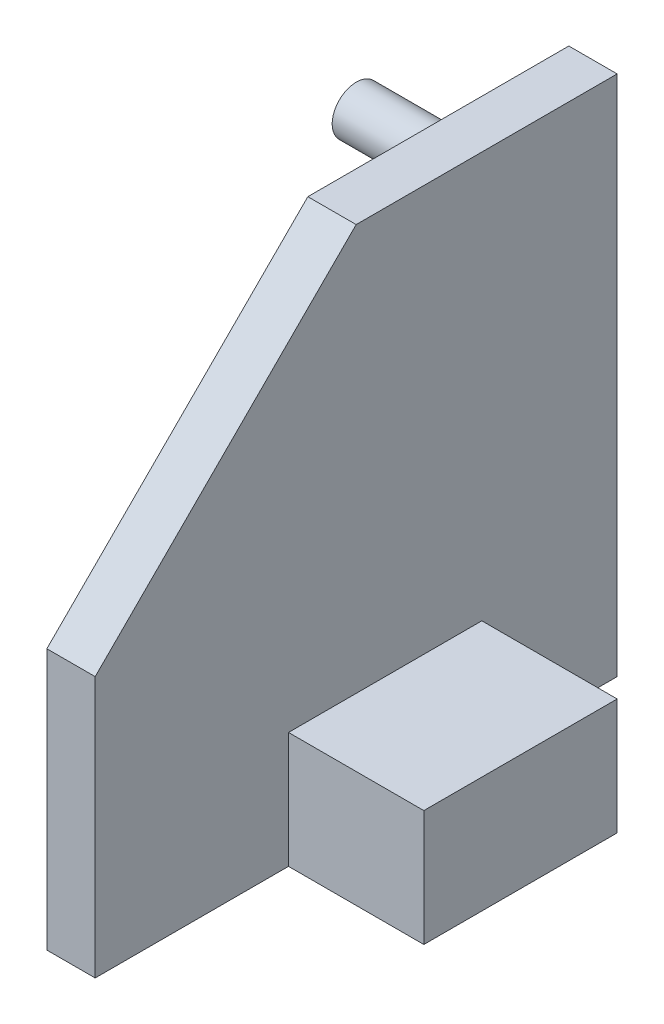
ISO-10303-21;
HEADER;
FILE_DESCRIPTION(('STEP AP214'),'2;1');
FILE_NAME('part.step','',(''),(''),'','','');
FILE_SCHEMA(('AUTOMOTIVE_DESIGN { 1 0 10303 214 1 1 1 1 }'));
ENDSEC;
DATA;
#1=APPLICATION_CONTEXT('core data for automotive mechanical design processes');
#2=APPLICATION_PROTOCOL_DEFINITION('international standard','automotive_design',2000,#1);
#3=PRODUCT_CONTEXT('',#1,'mechanical');
#4=PRODUCT('Part','Part','',(#3));
#5=PRODUCT_RELATED_PRODUCT_CATEGORY('part','',(#4));
#6=PRODUCT_DEFINITION_FORMATION('','',#4);
#7=PRODUCT_DEFINITION_CONTEXT('part definition',#1,'design');
#8=PRODUCT_DEFINITION('design','',#6,#7);
#9=PRODUCT_DEFINITION_SHAPE('','',#8);
#10=(LENGTH_UNIT() NAMED_UNIT(*) SI_UNIT(.MILLI.,.METRE.));
#11=(NAMED_UNIT(*) PLANE_ANGLE_UNIT() SI_UNIT($,.RADIAN.));
#12=(NAMED_UNIT(*) SI_UNIT($,.STERADIAN.) SOLID_ANGLE_UNIT());
#13=UNCERTAINTY_MEASURE_WITH_UNIT(LENGTH_MEASURE(1.E-05),#10,'distance_accuracy_value','');
#14=(GEOMETRIC_REPRESENTATION_CONTEXT(3) GLOBAL_UNCERTAINTY_ASSIGNED_CONTEXT((#13)) GLOBAL_UNIT_ASSIGNED_CONTEXT((#10,
#11,#12)) REPRESENTATION_CONTEXT('',''));
#15=CARTESIAN_POINT('',(0.,0.,0.));
#16=DIRECTION('',(0.,0.,1.));
#17=DIRECTION('',(1.,0.,0.));
#18=AXIS2_PLACEMENT_3D('',#15,#16,#17);
#19=CARTESIAN_POINT('',(2.5,0.,0.));
#20=DIRECTION('',(-1.,0.,0.));
#21=DIRECTION('',(0.,0.,1.));
#22=AXIS2_PLACEMENT_3D('',#19,#20,#21);
#23=PLANE('',#22);
#24=DIRECTION('',(0.,0.,1.));
#25=VECTOR('',#24,1.);
#26=CARTESIAN_POINT('',(2.5,27.,42.2709604363099));
#27=LINE('',#26,#25);
#28=CARTESIAN_POINT('',(2.5,27.,15.2709604363099));
#29=VERTEX_POINT('',#28);
#30=CARTESIAN_POINT('',(2.5,27.,28.7709604363099));
#31=VERTEX_POINT('',#30);
#32=EDGE_CURVE('E113',#29,#31,#27,.T.);
#33=ORIENTED_EDGE('',*,*,#32,.T.);
#34=DIRECTION('',(0.,0.707106781186548,-0.707106781186547));
#35=VECTOR('',#34,1.);
#36=CARTESIAN_POINT('',(2.5,13.5,42.2709604363099));
#37=LINE('',#36,#35);
#38=CARTESIAN_POINT('',(2.5,13.5,42.2709604363099));
#39=VERTEX_POINT('',#38);
#40=EDGE_CURVE('E104',#39,#31,#37,.T.);
#41=ORIENTED_EDGE('',*,*,#40,.F.);
#42=DIRECTION('',(0.,-1.,0.));
#43=VECTOR('',#42,1.);
#44=CARTESIAN_POINT('',(2.5,0.,42.2709604363099));
#45=LINE('',#44,#43);
#46=CARTESIAN_POINT('',(2.5,0.,42.2709604363099));
#47=VERTEX_POINT('',#46);
#48=EDGE_CURVE('E110',#39,#47,#45,.T.);
#49=ORIENTED_EDGE('',*,*,#48,.T.);
#50=DIRECTION('',(0.,0.,-1.));
#51=VECTOR('',#50,1.);
#52=CARTESIAN_POINT('',(2.5,0.,42.2709604363099));
#53=LINE('',#52,#51);
#54=CARTESIAN_POINT('',(2.5,0.,32.2709604363099));
#55=VERTEX_POINT('',#54);
#56=EDGE_CURVE('E121',#47,#55,#53,.T.);
#57=ORIENTED_EDGE('',*,*,#56,.T.);
#58=DIRECTION('',(0.,-1.,0.));
#59=VECTOR('',#58,1.);
#60=CARTESIAN_POINT('',(2.5,0.,32.2709604363099));
#61=LINE('',#60,#59);
#62=CARTESIAN_POINT('',(2.5,6.,32.2709604363099));
#63=VERTEX_POINT('',#62);
#64=EDGE_CURVE('E55',#63,#55,#61,.T.);
#65=ORIENTED_EDGE('',*,*,#64,.F.);
#66=DIRECTION('',(0.,0.,1.));
#67=VECTOR('',#66,1.);
#68=CARTESIAN_POINT('',(2.5,6.,32.2709604363099));
#69=LINE('',#68,#67);
#70=CARTESIAN_POINT('',(2.5,6.,22.2709604363099));
#71=VERTEX_POINT('',#70);
#72=EDGE_CURVE('E169',#71,#63,#69,.T.);
#73=ORIENTED_EDGE('',*,*,#72,.F.);
#74=DIRECTION('',(0.,1.,0.));
#75=VECTOR('',#74,1.);
#76=CARTESIAN_POINT('',(2.5,0.,22.2709604363099));
#77=LINE('',#76,#75);
#78=CARTESIAN_POINT('',(2.5,0.,22.2709604363099));
#79=VERTEX_POINT('',#78);
#80=EDGE_CURVE('E180',#79,#71,#77,.T.);
#81=ORIENTED_EDGE('',*,*,#80,.F.);
#82=CARTESIAN_POINT('',(2.5,0.,15.2709604363099));
#83=VERTEX_POINT('',#82);
#84=EDGE_CURVE('E118',#79,#83,#53,.T.);
#85=ORIENTED_EDGE('',*,*,#84,.T.);
#86=DIRECTION('',(0.,1.,0.));
#87=VECTOR('',#86,1.);
#88=CARTESIAN_POINT('',(2.5,0.,15.2709604363099));
#89=LINE('',#88,#87);
#90=EDGE_CURVE('E132',#83,#29,#89,.T.);
#91=ORIENTED_EDGE('',*,*,#90,.T.);
#92=EDGE_LOOP('',(#33,#41,#49,#57,#65,#73,#81,#85,#91));
#93=FACE_BOUND('',#92,.T.);
#94=ADVANCED_FACE('F33',(#93),#23,.F.);
#95=CARTESIAN_POINT('',(2.5,0.,42.2709604363099));
#96=DIRECTION('',(0.,0.,-1.));
#97=DIRECTION('',(-1.,0.,0.));
#98=AXIS2_PLACEMENT_3D('',#95,#96,#97);
#99=PLANE('',#98);
#100=ORIENTED_EDGE('',*,*,#48,.F.);
#101=DIRECTION('',(1.,0.,0.));
#102=VECTOR('',#101,1.);
#103=CARTESIAN_POINT('',(-6.,13.5,42.2709604363099));
#104=LINE('',#103,#102);
#105=CARTESIAN_POINT('',(0.,13.5,42.2709604363099));
#106=VERTEX_POINT('',#105);
#107=EDGE_CURVE('E101',#106,#39,#104,.T.);
#108=ORIENTED_EDGE('',*,*,#107,.F.);
#109=DIRECTION('',(0.,-1.,0.));
#110=VECTOR('',#109,1.);
#111=CARTESIAN_POINT('',(0.,0.,42.2709604363099));
#112=LINE('',#111,#110);
#113=CARTESIAN_POINT('',(0.,0.,42.2709604363099));
#114=VERTEX_POINT('',#113);
#115=EDGE_CURVE('E148',#106,#114,#112,.T.);
#116=ORIENTED_EDGE('',*,*,#115,.T.);
#117=DIRECTION('',(-1.,0.,0.));
#118=VECTOR('',#117,1.);
#119=CARTESIAN_POINT('',(2.5,0.,42.2709604363099));
#120=LINE('',#119,#118);
#121=EDGE_CURVE('E117',#47,#114,#120,.T.);
#122=ORIENTED_EDGE('',*,*,#121,.F.);
#123=EDGE_LOOP('',(#100,#108,#116,#122));
#124=FACE_BOUND('',#123,.T.);
#125=ADVANCED_FACE('F35',(#124),#99,.F.);
#126=CARTESIAN_POINT('',(2.5,0.,42.2709604363099));
#127=DIRECTION('',(0.,1.,0.));
#128=DIRECTION('',(0.,0.,1.));
#129=AXIS2_PLACEMENT_3D('',#126,#127,#128);
#130=PLANE('',#129);
#131=DIRECTION('',(0.,0.,-1.));
#132=VECTOR('',#131,1.);
#133=CARTESIAN_POINT('',(0.,0.,42.2709604363099));
#134=LINE('',#133,#132);
#135=CARTESIAN_POINT('',(0.,0.,15.2709604363099));
#136=VERTEX_POINT('',#135);
#137=EDGE_CURVE('E146',#114,#136,#134,.T.);
#138=ORIENTED_EDGE('',*,*,#137,.T.);
#139=DIRECTION('',(-1.,0.,0.));
#140=VECTOR('',#139,1.);
#141=CARTESIAN_POINT('',(2.5,0.,15.2709604363099));
#142=LINE('',#141,#140);
#143=EDGE_CURVE('E139',#83,#136,#142,.T.);
#144=ORIENTED_EDGE('',*,*,#143,.F.);
#145=ORIENTED_EDGE('',*,*,#84,.F.);
#146=DIRECTION('',(-1.,0.,0.));
#147=VECTOR('',#146,1.);
#148=CARTESIAN_POINT('',(9.5,0.,22.2709604363099));
#149=LINE('',#148,#147);
#150=CARTESIAN_POINT('',(9.5,0.,22.2709604363099));
#151=VERTEX_POINT('',#150);
#152=EDGE_CURVE('E301',#151,#79,#149,.T.);
#153=ORIENTED_EDGE('',*,*,#152,.F.);
#154=DIRECTION('',(0.,0.,-1.));
#155=VECTOR('',#154,1.);
#156=CARTESIAN_POINT('',(9.5,0.,32.2709604363099));
#157=LINE('',#156,#155);
#158=CARTESIAN_POINT('',(9.5,0.,32.2709604363099));
#159=VERTEX_POINT('',#158);
#160=EDGE_CURVE('E168',#159,#151,#157,.T.);
#161=ORIENTED_EDGE('',*,*,#160,.F.);
#162=DIRECTION('',(-1.,0.,0.));
#163=VECTOR('',#162,1.);
#164=CARTESIAN_POINT('',(9.5,0.,32.2709604363099));
#165=LINE('',#164,#163);
#166=EDGE_CURVE('E149',#159,#55,#165,.T.);
#167=ORIENTED_EDGE('',*,*,#166,.T.);
#168=ORIENTED_EDGE('',*,*,#56,.F.);
#169=ORIENTED_EDGE('',*,*,#121,.T.);
#170=EDGE_LOOP('',(#138,#144,#145,#153,#161,#167,#168,#169));
#171=FACE_BOUND('',#170,.T.);
#172=ADVANCED_FACE('F207',(#171),#130,.F.);
#173=CARTESIAN_POINT('',(2.5,0.,15.2709604363099));
#174=DIRECTION('',(0.,0.,1.));
#175=DIRECTION('',(1.,0.,0.));
#176=AXIS2_PLACEMENT_3D('',#173,#174,#175);
#177=PLANE('',#176);
#178=DIRECTION('',(0.,1.,0.));
#179=VECTOR('',#178,1.);
#180=CARTESIAN_POINT('',(0.,0.,15.2709604363099));
#181=LINE('',#180,#179);
#182=CARTESIAN_POINT('',(0.,27.,15.2709604363099));
#183=VERTEX_POINT('',#182);
#184=EDGE_CURVE('E124',#136,#183,#181,.T.);
#185=ORIENTED_EDGE('',*,*,#184,.T.);
#186=DIRECTION('',(-1.,0.,0.));
#187=VECTOR('',#186,1.);
#188=CARTESIAN_POINT('',(2.5,27.,15.2709604363099));
#189=LINE('',#188,#187);
#190=EDGE_CURVE('E142',#29,#183,#189,.T.);
#191=ORIENTED_EDGE('',*,*,#190,.F.);
#192=ORIENTED_EDGE('',*,*,#90,.F.);
#193=ORIENTED_EDGE('',*,*,#143,.T.);
#194=EDGE_LOOP('',(#185,#191,#192,#193));
#195=FACE_BOUND('',#194,.T.);
#196=ADVANCED_FACE('F155',(#195),#177,.F.);
#197=CARTESIAN_POINT('',(2.5,27.,42.2709604363099));
#198=DIRECTION('',(0.,-1.,0.));
#199=DIRECTION('',(0.,0.,-1.));
#200=AXIS2_PLACEMENT_3D('',#197,#198,#199);
#201=PLANE('',#200);
#202=DIRECTION('',(0.,0.,1.));
#203=VECTOR('',#202,1.);
#204=CARTESIAN_POINT('',(0.,27.,42.2709604363099));
#205=LINE('',#204,#203);
#206=CARTESIAN_POINT('',(0.,27.,28.7709604363099));
#207=VERTEX_POINT('',#206);
#208=EDGE_CURVE('E119',#183,#207,#205,.T.);
#209=ORIENTED_EDGE('',*,*,#208,.T.);
#210=DIRECTION('',(1.,0.,0.));
#211=VECTOR('',#210,1.);
#212=CARTESIAN_POINT('',(-6.,27.,28.7709604363099));
#213=LINE('',#212,#211);
#214=EDGE_CURVE('E47',#207,#31,#213,.T.);
#215=ORIENTED_EDGE('',*,*,#214,.T.);
#216=ORIENTED_EDGE('',*,*,#32,.F.);
#217=ORIENTED_EDGE('',*,*,#190,.T.);
#218=EDGE_LOOP('',(#209,#215,#216,#217));
#219=FACE_BOUND('',#218,.T.);
#220=ADVANCED_FACE('F159',(#219),#201,.F.);
#221=CARTESIAN_POINT('',(0.,0.,0.));
#222=DIRECTION('',(-1.,0.,0.));
#223=DIRECTION('',(0.,0.,1.));
#224=AXIS2_PLACEMENT_3D('',#221,#222,#223);
#225=PLANE('',#224);
#226=DIRECTION('',(0.,-0.707106781186548,0.707106781186547));
#227=VECTOR('',#226,1.);
#228=CARTESIAN_POINT('',(0.,27.8854802181549,27.8854802181549));
#229=LINE('',#228,#227);
#230=EDGE_CURVE('E11',#207,#106,#229,.T.);
#231=ORIENTED_EDGE('',*,*,#230,.F.);
#232=ORIENTED_EDGE('',*,*,#208,.F.);
#233=ORIENTED_EDGE('',*,*,#184,.F.);
#234=ORIENTED_EDGE('',*,*,#137,.F.);
#235=ORIENTED_EDGE('',*,*,#115,.F.);
#236=EDGE_LOOP('',(#231,#232,#233,#234,#235));
#237=FACE_BOUND('',#236,.T.);
#238=CARTESIAN_POINT('',(0.,23.63,20.2609604363099));
#239=DIRECTION('',(-1.,0.,0.));
#240=DIRECTION('',(0.,0.,1.));
#241=AXIS2_PLACEMENT_3D('',#238,#239,#240);
#242=CIRCLE('',#241,1.25);
#243=CARTESIAN_POINT('',(0.,23.63,21.5109604363099));
#244=VERTEX_POINT('',#243);
#245=EDGE_CURVE('E41',#244,#244,#242,.T.);
#246=ORIENTED_EDGE('',*,*,#245,.F.);
#247=EDGE_LOOP('',(#246));
#248=FACE_BOUND('',#247,.T.);
#249=ADVANCED_FACE('F189',(#237,#248),#225,.T.);
#250=CARTESIAN_POINT('',(9.5,0.,32.2709604363099));
#251=DIRECTION('',(0.,0.,-1.));
#252=DIRECTION('',(-1.,0.,0.));
#253=AXIS2_PLACEMENT_3D('',#250,#251,#252);
#254=PLANE('',#253);
#255=ORIENTED_EDGE('',*,*,#64,.T.);
#256=ORIENTED_EDGE('',*,*,#166,.F.);
#257=DIRECTION('',(0.,-1.,0.));
#258=VECTOR('',#257,1.);
#259=CARTESIAN_POINT('',(9.5,0.,32.2709604363099));
#260=LINE('',#259,#258);
#261=CARTESIAN_POINT('',(9.5,6.,32.2709604363099));
#262=VERTEX_POINT('',#261);
#263=EDGE_CURVE('E165',#262,#159,#260,.T.);
#264=ORIENTED_EDGE('',*,*,#263,.F.);
#265=DIRECTION('',(-1.,0.,0.));
#266=VECTOR('',#265,1.);
#267=CARTESIAN_POINT('',(9.5,6.,32.2709604363099));
#268=LINE('',#267,#266);
#269=EDGE_CURVE('E175',#262,#63,#268,.T.);
#270=ORIENTED_EDGE('',*,*,#269,.T.);
#271=EDGE_LOOP('',(#255,#256,#264,#270));
#272=FACE_BOUND('',#271,.T.);
#273=ADVANCED_FACE('F191',(#272),#254,.F.);
#274=CARTESIAN_POINT('',(9.5,0.,22.2709604363099));
#275=DIRECTION('',(0.,0.,1.));
#276=DIRECTION('',(1.,0.,0.));
#277=AXIS2_PLACEMENT_3D('',#274,#275,#276);
#278=PLANE('',#277);
#279=ORIENTED_EDGE('',*,*,#80,.T.);
#280=DIRECTION('',(-1.,0.,0.));
#281=VECTOR('',#280,1.);
#282=CARTESIAN_POINT('',(9.5,6.,22.2709604363099));
#283=LINE('',#282,#281);
#284=CARTESIAN_POINT('',(9.5,6.,22.2709604363099));
#285=VERTEX_POINT('',#284);
#286=EDGE_CURVE('E128',#285,#71,#283,.T.);
#287=ORIENTED_EDGE('',*,*,#286,.F.);
#288=DIRECTION('',(0.,1.,0.));
#289=VECTOR('',#288,1.);
#290=CARTESIAN_POINT('',(9.5,0.,22.2709604363099));
#291=LINE('',#290,#289);
#292=EDGE_CURVE('E171',#151,#285,#291,.T.);
#293=ORIENTED_EDGE('',*,*,#292,.F.);
#294=ORIENTED_EDGE('',*,*,#152,.T.);
#295=EDGE_LOOP('',(#279,#287,#293,#294));
#296=FACE_BOUND('',#295,.T.);
#297=ADVANCED_FACE('F198',(#296),#278,.F.);
#298=CARTESIAN_POINT('',(9.5,6.,32.2709604363099));
#299=DIRECTION('',(0.,-1.,0.));
#300=DIRECTION('',(0.,0.,-1.));
#301=AXIS2_PLACEMENT_3D('',#298,#299,#300);
#302=PLANE('',#301);
#303=ORIENTED_EDGE('',*,*,#72,.T.);
#304=ORIENTED_EDGE('',*,*,#269,.F.);
#305=DIRECTION('',(0.,0.,1.));
#306=VECTOR('',#305,1.);
#307=CARTESIAN_POINT('',(9.5,6.,32.2709604363099));
#308=LINE('',#307,#306);
#309=EDGE_CURVE('E173',#285,#262,#308,.T.);
#310=ORIENTED_EDGE('',*,*,#309,.F.);
#311=ORIENTED_EDGE('',*,*,#286,.T.);
#312=EDGE_LOOP('',(#303,#304,#310,#311));
#313=FACE_BOUND('',#312,.T.);
#314=ADVANCED_FACE('F211',(#313),#302,.F.);
#315=CARTESIAN_POINT('',(9.5,0.,0.));
#316=DIRECTION('',(-1.,0.,0.));
#317=DIRECTION('',(0.,0.,1.));
#318=AXIS2_PLACEMENT_3D('',#315,#316,#317);
#319=PLANE('',#318);
#320=ORIENTED_EDGE('',*,*,#263,.T.);
#321=ORIENTED_EDGE('',*,*,#160,.T.);
#322=ORIENTED_EDGE('',*,*,#292,.T.);
#323=ORIENTED_EDGE('',*,*,#309,.T.);
#324=EDGE_LOOP('',(#320,#321,#322,#323));
#325=FACE_BOUND('',#324,.T.);
#326=ADVANCED_FACE('F215',(#325),#319,.F.);
#327=CARTESIAN_POINT('',(-6.,23.63,20.2609604363099));
#328=DIRECTION('',(1.,0.,0.));
#329=DIRECTION('',(0.,0.,-1.));
#330=AXIS2_PLACEMENT_3D('',#327,#328,#329);
#331=CYLINDRICAL_SURFACE('',#330,1.25);
#332=ORIENTED_EDGE('',*,*,#245,.T.);
#333=EDGE_LOOP('',(#332));
#334=FACE_BOUND('',#333,.T.);
#335=CARTESIAN_POINT('',(-6.,23.63,20.2609604363099));
#336=DIRECTION('',(1.,0.,0.));
#337=DIRECTION('',(0.,0.,-1.));
#338=AXIS2_PLACEMENT_3D('',#335,#336,#337);
#339=CIRCLE('',#338,1.25);
#340=CARTESIAN_POINT('',(-6.,23.63,19.0109604363099));
#341=VERTEX_POINT('',#340);
#342=EDGE_CURVE('E160',#341,#341,#339,.T.);
#343=ORIENTED_EDGE('',*,*,#342,.T.);
#344=EDGE_LOOP('',(#343));
#345=FACE_BOUND('',#344,.T.);
#346=ADVANCED_FACE('F186',(#334,#345),#331,.T.);
#347=CARTESIAN_POINT('',(-6.,23.63,20.2609604363099));
#348=DIRECTION('',(1.,0.,0.));
#349=DIRECTION('',(0.,0.,-1.));
#350=AXIS2_PLACEMENT_3D('',#347,#348,#349);
#351=PLANE('',#350);
#352=ORIENTED_EDGE('',*,*,#342,.F.);
#353=EDGE_LOOP('',(#352));
#354=FACE_BOUND('',#353,.T.);
#355=ADVANCED_FACE('F222',(#354),#351,.F.);
#356=CARTESIAN_POINT('',(-6.,13.5,42.2709604363099));
#357=DIRECTION('',(0.,-0.707106781186547,-0.707106781186548));
#358=DIRECTION('',(0.,0.707106781186548,-0.707106781186547));
#359=AXIS2_PLACEMENT_3D('',#356,#357,#358);
#360=PLANE('',#359);
#361=ORIENTED_EDGE('',*,*,#230,.T.);
#362=ORIENTED_EDGE('',*,*,#107,.T.);
#363=ORIENTED_EDGE('',*,*,#40,.T.);
#364=ORIENTED_EDGE('',*,*,#214,.F.);
#365=EDGE_LOOP('',(#361,#362,#363,#364));
#366=FACE_BOUND('',#365,.T.);
#367=ADVANCED_FACE('F103',(#366),#360,.F.);
#368=CLOSED_SHELL('',(#94,#125,#172,#196,#220,#249,#273,#297,#314,#326,#346,#355,#367));
#369=MANIFOLD_SOLID_BREP('B2',#368);
#370=ADVANCED_BREP_SHAPE_REPRESENTATION('',(#18,#369),#14);
#371=SHAPE_DEFINITION_REPRESENTATION(#9,#370);
ENDSEC;
END-ISO-10303-21;
